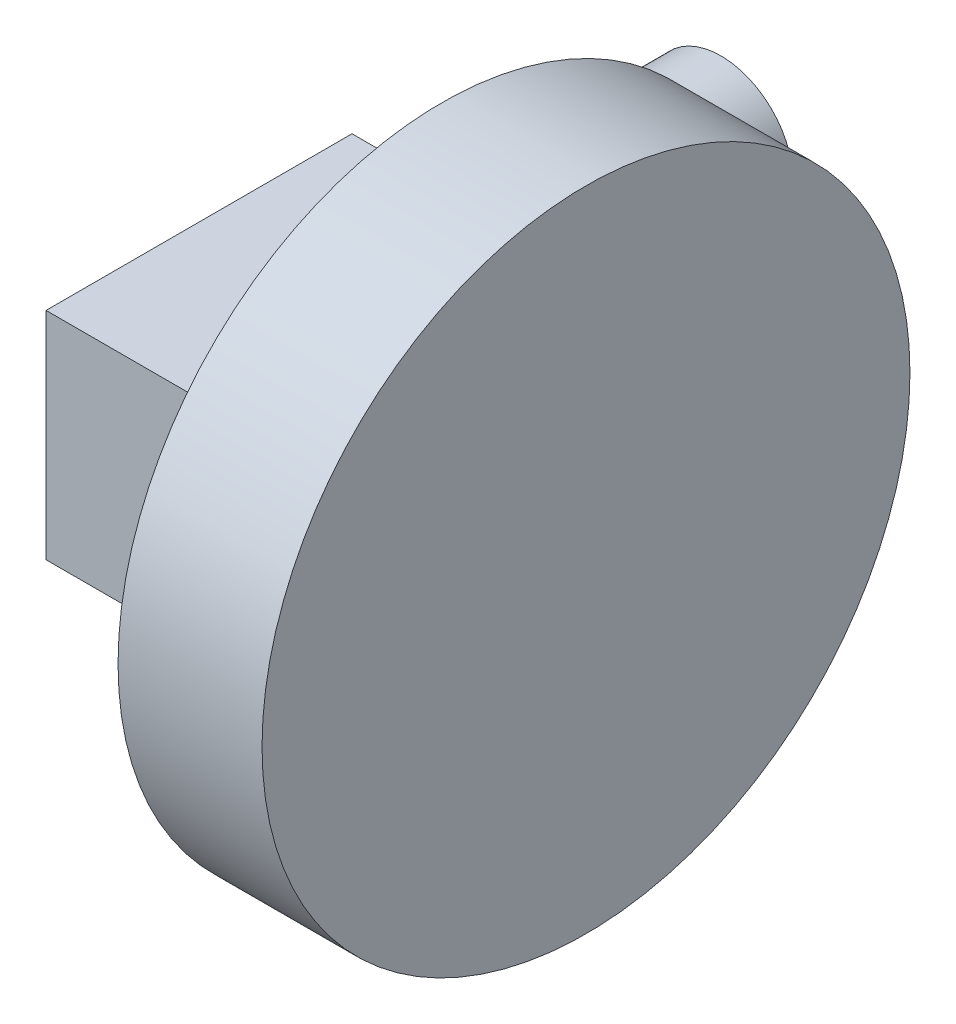
ISO-10303-21;
HEADER;
FILE_DESCRIPTION(('STEP AP214'),'2;1');
FILE_NAME('part.step','',(''),(''),'','','');
FILE_SCHEMA(('AUTOMOTIVE_DESIGN { 1 0 10303 214 1 1 1 1 }'));
ENDSEC;
DATA;
#1=APPLICATION_CONTEXT('core data for automotive mechanical design processes');
#2=APPLICATION_PROTOCOL_DEFINITION('international standard','automotive_design',2000,#1);
#3=PRODUCT_CONTEXT('',#1,'mechanical');
#4=PRODUCT('Part','Part','',(#3));
#5=PRODUCT_RELATED_PRODUCT_CATEGORY('part','',(#4));
#6=PRODUCT_DEFINITION_FORMATION('','',#4);
#7=PRODUCT_DEFINITION_CONTEXT('part definition',#1,'design');
#8=PRODUCT_DEFINITION('design','',#6,#7);
#9=PRODUCT_DEFINITION_SHAPE('','',#8);
#10=(LENGTH_UNIT() NAMED_UNIT(*) SI_UNIT(.MILLI.,.METRE.));
#11=(NAMED_UNIT(*) PLANE_ANGLE_UNIT() SI_UNIT($,.RADIAN.));
#12=(NAMED_UNIT(*) SI_UNIT($,.STERADIAN.) SOLID_ANGLE_UNIT());
#13=UNCERTAINTY_MEASURE_WITH_UNIT(LENGTH_MEASURE(1.E-05),#10,'distance_accuracy_value','');
#14=(GEOMETRIC_REPRESENTATION_CONTEXT(3) GLOBAL_UNCERTAINTY_ASSIGNED_CONTEXT((#13)) GLOBAL_UNIT_ASSIGNED_CONTEXT((#10,
#11,#12)) REPRESENTATION_CONTEXT('',''));
#15=CARTESIAN_POINT('',(0.,0.,0.));
#16=DIRECTION('',(0.,0.,1.));
#17=DIRECTION('',(1.,0.,0.));
#18=AXIS2_PLACEMENT_3D('',#15,#16,#17);
#19=CARTESIAN_POINT('',(90.,0.,0.));
#20=DIRECTION('',(0.,0.,-1.));
#21=DIRECTION('',(-1.,0.,0.));
#22=AXIS2_PLACEMENT_3D('',#19,#20,#21);
#23=PLANE('',#22);
#24=DIRECTION('',(0.,-1.,0.));
#25=VECTOR('',#24,1.);
#26=CARTESIAN_POINT('',(0.,0.,0.));
#27=LINE('',#26,#25);
#28=CARTESIAN_POINT('',(0.,120.,0.));
#29=VERTEX_POINT('',#28);
#30=CARTESIAN_POINT('',(0.,0.,0.));
#31=VERTEX_POINT('',#30);
#32=EDGE_CURVE('E99',#29,#31,#27,.T.);
#33=ORIENTED_EDGE('',*,*,#32,.T.);
#34=DIRECTION('',(-1.,0.,0.));
#35=VECTOR('',#34,1.);
#36=CARTESIAN_POINT('',(90.,0.,0.));
#37=LINE('',#36,#35);
#38=CARTESIAN_POINT('',(90.,0.,0.));
#39=VERTEX_POINT('',#38);
#40=EDGE_CURVE('E90',#39,#31,#37,.T.);
#41=ORIENTED_EDGE('',*,*,#40,.F.);
#42=DIRECTION('',(0.,-1.,0.));
#43=VECTOR('',#42,1.);
#44=CARTESIAN_POINT('',(90.,0.,0.));
#45=LINE('',#44,#43);
#46=CARTESIAN_POINT('',(90.,120.,0.));
#47=VERTEX_POINT('',#46);
#48=EDGE_CURVE('E84',#47,#39,#45,.T.);
#49=ORIENTED_EDGE('',*,*,#48,.F.);
#50=DIRECTION('',(-1.,0.,0.));
#51=VECTOR('',#50,1.);
#52=CARTESIAN_POINT('',(90.,120.,0.));
#53=LINE('',#52,#51);
#54=EDGE_CURVE('E95',#47,#29,#53,.T.);
#55=ORIENTED_EDGE('',*,*,#54,.T.);
#56=EDGE_LOOP('',(#33,#41,#49,#55));
#57=FACE_BOUND('',#56,.T.);
#58=ADVANCED_FACE('F32',(#57),#23,.F.);
#59=CARTESIAN_POINT('',(90.,0.,0.));
#60=DIRECTION('',(0.,1.,0.));
#61=DIRECTION('',(0.,0.,1.));
#62=AXIS2_PLACEMENT_3D('',#59,#60,#61);
#63=PLANE('',#62);
#64=DIRECTION('',(0.,0.,-1.));
#65=VECTOR('',#64,1.);
#66=CARTESIAN_POINT('',(0.,0.,0.));
#67=LINE('',#66,#65);
#68=CARTESIAN_POINT('',(0.,0.,-170.));
#69=VERTEX_POINT('',#68);
#70=EDGE_CURVE('E89',#31,#69,#67,.T.);
#71=ORIENTED_EDGE('',*,*,#70,.T.);
#72=DIRECTION('',(-1.,0.,0.));
#73=VECTOR('',#72,1.);
#74=CARTESIAN_POINT('',(90.,0.,-170.));
#75=LINE('',#74,#73);
#76=CARTESIAN_POINT('',(90.,0.,-170.));
#77=VERTEX_POINT('',#76);
#78=EDGE_CURVE('E87',#77,#69,#75,.T.);
#79=ORIENTED_EDGE('',*,*,#78,.F.);
#80=DIRECTION('',(0.,0.,-1.));
#81=VECTOR('',#80,1.);
#82=CARTESIAN_POINT('',(90.,0.,0.));
#83=LINE('',#82,#81);
#84=EDGE_CURVE('E79',#39,#77,#83,.T.);
#85=ORIENTED_EDGE('',*,*,#84,.F.);
#86=ORIENTED_EDGE('',*,*,#40,.T.);
#87=EDGE_LOOP('',(#71,#79,#85,#86));
#88=FACE_BOUND('',#87,.T.);
#89=ADVANCED_FACE('F88',(#88),#63,.F.);
#90=CARTESIAN_POINT('',(90.,0.,-170.));
#91=DIRECTION('',(0.,0.,1.));
#92=DIRECTION('',(1.,0.,0.));
#93=AXIS2_PLACEMENT_3D('',#90,#91,#92);
#94=PLANE('',#93);
#95=CARTESIAN_POINT('',(45.,60.,-170.));
#96=DIRECTION('',(0.,0.,-1.));
#97=DIRECTION('',(-1.,0.,0.));
#98=AXIS2_PLACEMENT_3D('',#95,#96,#97);
#99=CIRCLE('',#98,40.);
#100=CARTESIAN_POINT('',(4.99999999999999,60.,-170.));
#101=VERTEX_POINT('',#100);
#102=EDGE_CURVE('E40',#101,#101,#99,.T.);
#103=ORIENTED_EDGE('',*,*,#102,.F.);
#104=EDGE_LOOP('',(#103));
#105=FACE_BOUND('',#104,.T.);
#106=DIRECTION('',(0.,1.,0.));
#107=VECTOR('',#106,1.);
#108=CARTESIAN_POINT('',(0.,0.,-170.));
#109=LINE('',#108,#107);
#110=CARTESIAN_POINT('',(0.,120.,-170.));
#111=VERTEX_POINT('',#110);
#112=EDGE_CURVE('E65',#69,#111,#109,.T.);
#113=ORIENTED_EDGE('',*,*,#112,.T.);
#114=DIRECTION('',(-1.,0.,0.));
#115=VECTOR('',#114,1.);
#116=CARTESIAN_POINT('',(90.,120.,-170.));
#117=LINE('',#116,#115);
#118=CARTESIAN_POINT('',(90.,120.,-170.));
#119=VERTEX_POINT('',#118);
#120=EDGE_CURVE('E91',#119,#111,#117,.T.);
#121=ORIENTED_EDGE('',*,*,#120,.F.);
#122=DIRECTION('',(0.,1.,0.));
#123=VECTOR('',#122,1.);
#124=CARTESIAN_POINT('',(90.,0.,-170.));
#125=LINE('',#124,#123);
#126=EDGE_CURVE('E82',#77,#119,#125,.T.);
#127=ORIENTED_EDGE('',*,*,#126,.F.);
#128=ORIENTED_EDGE('',*,*,#78,.T.);
#129=EDGE_LOOP('',(#113,#121,#127,#128));
#130=FACE_BOUND('',#129,.T.);
#131=ADVANCED_FACE('F93',(#105,#130),#94,.F.);
#132=CARTESIAN_POINT('',(90.,120.,0.));
#133=DIRECTION('',(0.,-1.,0.));
#134=DIRECTION('',(0.,0.,-1.));
#135=AXIS2_PLACEMENT_3D('',#132,#133,#134);
#136=PLANE('',#135);
#137=DIRECTION('',(0.,0.,1.));
#138=VECTOR('',#137,1.);
#139=CARTESIAN_POINT('',(0.,120.,0.));
#140=LINE('',#139,#138);
#141=EDGE_CURVE('E71',#111,#29,#140,.T.);
#142=ORIENTED_EDGE('',*,*,#141,.T.);
#143=ORIENTED_EDGE('',*,*,#54,.F.);
#144=DIRECTION('',(0.,0.,1.));
#145=VECTOR('',#144,1.);
#146=CARTESIAN_POINT('',(90.,120.,0.));
#147=LINE('',#146,#145);
#148=EDGE_CURVE('E48',#119,#47,#147,.T.);
#149=ORIENTED_EDGE('',*,*,#148,.F.);
#150=ORIENTED_EDGE('',*,*,#120,.T.);
#151=EDGE_LOOP('',(#142,#143,#149,#150));
#152=FACE_BOUND('',#151,.T.);
#153=ADVANCED_FACE('F159',(#152),#136,.F.);
#154=CARTESIAN_POINT('',(90.,0.,0.));
#155=DIRECTION('',(-1.,0.,0.));
#156=DIRECTION('',(0.,0.,1.));
#157=AXIS2_PLACEMENT_3D('',#154,#155,#156);
#158=PLANE('',#157);
#159=CARTESIAN_POINT('',(90.,70.,-80.));
#160=DIRECTION('',(-1.,0.,0.));
#161=DIRECTION('',(0.,0.,1.));
#162=AXIS2_PLACEMENT_3D('',#159,#160,#161);
#163=CIRCLE('',#162,5.00000000000001);
#164=CARTESIAN_POINT('',(90.,70.,-75.));
#165=VERTEX_POINT('',#164);
#166=EDGE_CURVE('E11',#165,#165,#163,.F.);
#167=ORIENTED_EDGE('',*,*,#166,.F.);
#168=EDGE_LOOP('',(#167));
#169=FACE_BOUND('',#168,.T.);
#170=ORIENTED_EDGE('',*,*,#48,.T.);
#171=ORIENTED_EDGE('',*,*,#84,.T.);
#172=ORIENTED_EDGE('',*,*,#126,.T.);
#173=ORIENTED_EDGE('',*,*,#148,.T.);
#174=EDGE_LOOP('',(#170,#171,#172,#173));
#175=FACE_BOUND('',#174,.T.);
#176=ADVANCED_FACE('F80',(#169,#175),#158,.F.);
#177=CARTESIAN_POINT('',(0.,0.,0.));
#178=DIRECTION('',(-1.,0.,0.));
#179=DIRECTION('',(0.,0.,1.));
#180=AXIS2_PLACEMENT_3D('',#177,#178,#179);
#181=PLANE('',#180);
#182=ORIENTED_EDGE('',*,*,#32,.F.);
#183=ORIENTED_EDGE('',*,*,#141,.F.);
#184=ORIENTED_EDGE('',*,*,#112,.F.);
#185=ORIENTED_EDGE('',*,*,#70,.F.);
#186=EDGE_LOOP('',(#182,#183,#184,#185));
#187=FACE_BOUND('',#186,.T.);
#188=ADVANCED_FACE('F148',(#187),#181,.T.);
#189=CARTESIAN_POINT('',(45.,60.,-330.));
#190=DIRECTION('',(0.,0.,1.));
#191=DIRECTION('',(1.,0.,0.));
#192=AXIS2_PLACEMENT_3D('',#189,#190,#191);
#193=CYLINDRICAL_SURFACE('',#192,40.);
#194=CARTESIAN_POINT('',(45.,60.,-330.));
#195=DIRECTION('',(0.,0.,-1.));
#196=DIRECTION('',(-1.,0.,0.));
#197=AXIS2_PLACEMENT_3D('',#194,#195,#196);
#198=CIRCLE('',#197,40.);
#199=CARTESIAN_POINT('',(4.99999999999999,60.,-330.));
#200=VERTEX_POINT('',#199);
#201=EDGE_CURVE('E102',#200,#200,#198,.T.);
#202=ORIENTED_EDGE('',*,*,#201,.F.);
#203=EDGE_LOOP('',(#202));
#204=FACE_BOUND('',#203,.T.);
#205=ORIENTED_EDGE('',*,*,#102,.T.);
#206=EDGE_LOOP('',(#205));
#207=FACE_BOUND('',#206,.T.);
#208=ADVANCED_FACE('F150',(#204,#207),#193,.T.);
#209=CARTESIAN_POINT('',(45.,60.,-330.));
#210=DIRECTION('',(0.,0.,-1.));
#211=DIRECTION('',(-1.,0.,0.));
#212=AXIS2_PLACEMENT_3D('',#209,#210,#211);
#213=PLANE('',#212);
#214=ORIENTED_EDGE('',*,*,#201,.T.);
#215=EDGE_LOOP('',(#214));
#216=FACE_BOUND('',#215,.T.);
#217=ADVANCED_FACE('F156',(#216),#213,.T.);
#218=CARTESIAN_POINT('',(140.,70.,-80.));
#219=DIRECTION('',(-1.,0.,0.));
#220=DIRECTION('',(0.,0.,1.));
#221=AXIS2_PLACEMENT_3D('',#218,#219,#220);
#222=CYLINDRICAL_SURFACE('',#221,5.00000000000001);
#223=CARTESIAN_POINT('',(140.,70.,-80.));
#224=DIRECTION('',(1.,0.,0.));
#225=DIRECTION('',(0.,0.,-1.));
#226=AXIS2_PLACEMENT_3D('',#223,#224,#225);
#227=CIRCLE('',#226,5.00000000000001);
#228=CARTESIAN_POINT('',(140.,70.,-85.));
#229=VERTEX_POINT('',#228);
#230=EDGE_CURVE('E114',#229,#229,#227,.T.);
#231=ORIENTED_EDGE('',*,*,#230,.F.);
#232=EDGE_LOOP('',(#231));
#233=FACE_BOUND('',#232,.T.);
#234=ORIENTED_EDGE('',*,*,#166,.T.);
#235=EDGE_LOOP('',(#234));
#236=FACE_BOUND('',#235,.T.);
#237=ADVANCED_FACE('F129',(#233,#236),#222,.T.);
#238=CARTESIAN_POINT('',(220.,70.,-80.));
#239=DIRECTION('',(-1.,0.,0.));
#240=DIRECTION('',(0.,0.,1.));
#241=AXIS2_PLACEMENT_3D('',#238,#239,#240);
#242=CYLINDRICAL_SURFACE('',#241,180.);
#243=CARTESIAN_POINT('',(220.,70.,-80.));
#244=DIRECTION('',(1.,0.,0.));
#245=DIRECTION('',(0.,0.,-1.));
#246=AXIS2_PLACEMENT_3D('',#243,#244,#245);
#247=CIRCLE('',#246,180.);
#248=CARTESIAN_POINT('',(220.,70.,-260.));
#249=VERTEX_POINT('',#248);
#250=EDGE_CURVE('E117',#249,#249,#247,.T.);
#251=ORIENTED_EDGE('',*,*,#250,.F.);
#252=EDGE_LOOP('',(#251));
#253=FACE_BOUND('',#252,.T.);
#254=CARTESIAN_POINT('',(140.,70.,-80.));
#255=DIRECTION('',(1.,0.,0.));
#256=DIRECTION('',(0.,0.,-1.));
#257=AXIS2_PLACEMENT_3D('',#254,#255,#256);
#258=CIRCLE('',#257,180.);
#259=CARTESIAN_POINT('',(140.,70.,-260.));
#260=VERTEX_POINT('',#259);
#261=EDGE_CURVE('E118',#260,#260,#258,.T.);
#262=ORIENTED_EDGE('',*,*,#261,.T.);
#263=EDGE_LOOP('',(#262));
#264=FACE_BOUND('',#263,.T.);
#265=ADVANCED_FACE('F126',(#253,#264),#242,.T.);
#266=CARTESIAN_POINT('',(220.,70.,-80.));
#267=DIRECTION('',(1.,0.,0.));
#268=DIRECTION('',(0.,0.,-1.));
#269=AXIS2_PLACEMENT_3D('',#266,#267,#268);
#270=PLANE('',#269);
#271=ORIENTED_EDGE('',*,*,#250,.T.);
#272=EDGE_LOOP('',(#271));
#273=FACE_BOUND('',#272,.T.);
#274=ADVANCED_FACE('F124',(#273),#270,.T.);
#275=CARTESIAN_POINT('',(140.,70.,-80.));
#276=DIRECTION('',(1.,0.,0.));
#277=DIRECTION('',(0.,0.,-1.));
#278=AXIS2_PLACEMENT_3D('',#275,#276,#277);
#279=PLANE('',#278);
#280=ORIENTED_EDGE('',*,*,#230,.T.);
#281=EDGE_LOOP('',(#280));
#282=FACE_BOUND('',#281,.T.);
#283=ORIENTED_EDGE('',*,*,#261,.F.);
#284=EDGE_LOOP('',(#283));
#285=FACE_BOUND('',#284,.T.);
#286=ADVANCED_FACE('F133',(#282,#285),#279,.F.);
#287=CLOSED_SHELL('',(#58,#89,#131,#153,#176,#188,#208,#217,#237,#265,#274,#286));
#288=MANIFOLD_SOLID_BREP('B2',#287);
#289=ADVANCED_BREP_SHAPE_REPRESENTATION('',(#18,#288),#14);
#290=SHAPE_DEFINITION_REPRESENTATION(#9,#289);
ENDSEC;
END-ISO-10303-21;
